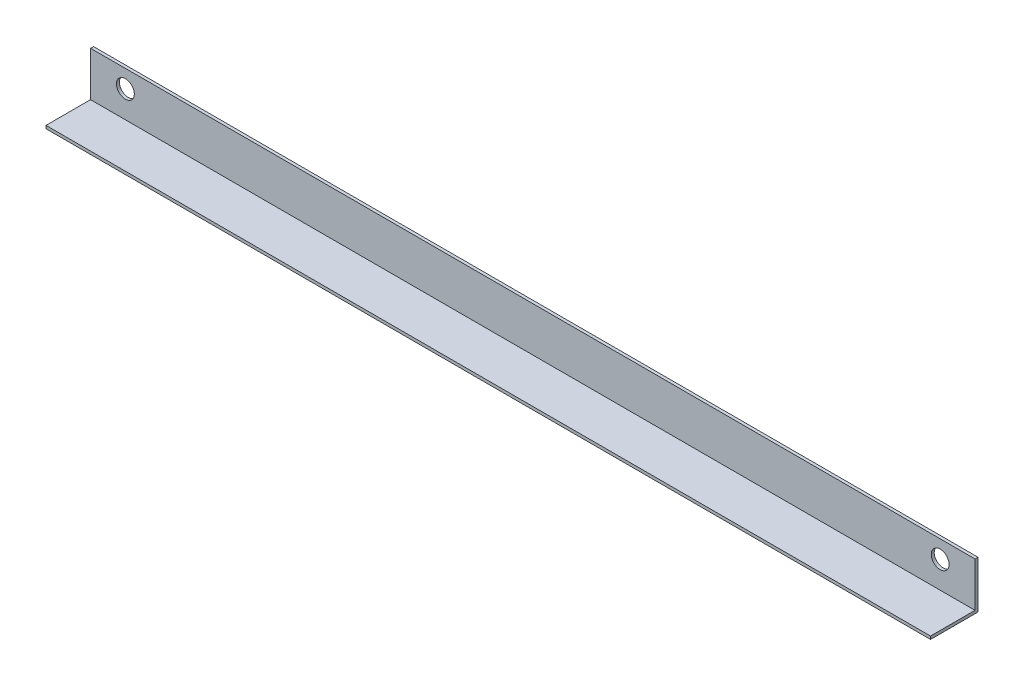
ISO-10303-21;
HEADER;
FILE_DESCRIPTION(('STEP AP214'),'2;1');
FILE_NAME('part.step','',(''),(''),'','','');
FILE_SCHEMA(('AUTOMOTIVE_DESIGN { 1 0 10303 214 1 1 1 1 }'));
ENDSEC;
DATA;
#1=APPLICATION_CONTEXT('core data for automotive mechanical design processes');
#2=APPLICATION_PROTOCOL_DEFINITION('international standard','automotive_design',2000,#1);
#3=PRODUCT_CONTEXT('',#1,'mechanical');
#4=PRODUCT('Part','Part','',(#3));
#5=PRODUCT_RELATED_PRODUCT_CATEGORY('part','',(#4));
#6=PRODUCT_DEFINITION_FORMATION('','',#4);
#7=PRODUCT_DEFINITION_CONTEXT('part definition',#1,'design');
#8=PRODUCT_DEFINITION('design','',#6,#7);
#9=PRODUCT_DEFINITION_SHAPE('','',#8);
#10=(LENGTH_UNIT() NAMED_UNIT(*) SI_UNIT(.MILLI.,.METRE.));
#11=(NAMED_UNIT(*) PLANE_ANGLE_UNIT() SI_UNIT($,.RADIAN.));
#12=(NAMED_UNIT(*) SI_UNIT($,.STERADIAN.) SOLID_ANGLE_UNIT());
#13=UNCERTAINTY_MEASURE_WITH_UNIT(LENGTH_MEASURE(1.E-05),#10,'distance_accuracy_value','');
#14=(GEOMETRIC_REPRESENTATION_CONTEXT(3) GLOBAL_UNCERTAINTY_ASSIGNED_CONTEXT((#13)) GLOBAL_UNIT_ASSIGNED_CONTEXT((#10,
#11,#12)) REPRESENTATION_CONTEXT('',''));
#15=CARTESIAN_POINT('',(0.,0.,0.));
#16=DIRECTION('',(0.,0.,1.));
#17=DIRECTION('',(1.,0.,0.));
#18=AXIS2_PLACEMENT_3D('',#15,#16,#17);
#19=CARTESIAN_POINT('',(-473.075,22.225,-25.4));
#20=DIRECTION('',(0.,0.,1.));
#21=DIRECTION('',(1.,0.,0.));
#22=AXIS2_PLACEMENT_3D('',#19,#20,#21);
#23=PLANE('',#22);
#24=CARTESIAN_POINT('',(435.76875,3.175,-25.4));
#25=DIRECTION('',(0.,0.,1.));
#26=DIRECTION('',(1.,0.,0.));
#27=AXIS2_PLACEMENT_3D('',#24,#25,#26);
#28=CIRCLE('',#27,9.525);
#29=CARTESIAN_POINT('',(445.29375,3.175,-25.4));
#30=VERTEX_POINT('',#29);
#31=EDGE_CURVE('E90',#30,#30,#28,.F.);
#32=ORIENTED_EDGE('',*,*,#31,.T.);
#33=EDGE_LOOP('',(#32));
#34=FACE_BOUND('',#33,.T.);
#35=CARTESIAN_POINT('',(-435.76875,3.175,-25.4));
#36=DIRECTION('',(0.,0.,1.));
#37=DIRECTION('',(1.,0.,0.));
#38=AXIS2_PLACEMENT_3D('',#35,#36,#37);
#39=CIRCLE('',#38,9.525);
#40=CARTESIAN_POINT('',(-426.24375,3.175,-25.4));
#41=VERTEX_POINT('',#40);
#42=EDGE_CURVE('E20',#41,#41,#39,.F.);
#43=ORIENTED_EDGE('',*,*,#42,.T.);
#44=EDGE_LOOP('',(#43));
#45=FACE_BOUND('',#44,.T.);
#46=DIRECTION('',(0.,1.,0.));
#47=VECTOR('',#46,1.);
#48=CARTESIAN_POINT('',(-473.075,0.,-25.4));
#49=LINE('',#48,#47);
#50=CARTESIAN_POINT('',(-473.075,22.225,-25.4));
#51=VERTEX_POINT('',#50);
#52=CARTESIAN_POINT('',(-473.075,-25.4,-25.4));
#53=VERTEX_POINT('',#52);
#54=EDGE_CURVE('E116',#51,#53,#49,.F.);
#55=ORIENTED_EDGE('',*,*,#54,.T.);
#56=DIRECTION('',(1.,0.,0.));
#57=VECTOR('',#56,1.);
#58=CARTESIAN_POINT('',(-473.075,-25.4,-25.4));
#59=LINE('',#58,#57);
#60=CARTESIAN_POINT('',(473.075,-25.4,-25.4));
#61=VERTEX_POINT('',#60);
#62=EDGE_CURVE('E67',#61,#53,#59,.F.);
#63=ORIENTED_EDGE('',*,*,#62,.F.);
#64=DIRECTION('',(0.,1.,0.));
#65=VECTOR('',#64,1.);
#66=CARTESIAN_POINT('',(473.075,0.,-25.4));
#67=LINE('',#66,#65);
#68=CARTESIAN_POINT('',(473.075,22.225,-25.4));
#69=VERTEX_POINT('',#68);
#70=EDGE_CURVE('E82',#69,#61,#67,.F.);
#71=ORIENTED_EDGE('',*,*,#70,.F.);
#72=DIRECTION('',(1.,0.,0.));
#73=VECTOR('',#72,1.);
#74=CARTESIAN_POINT('',(-473.075,22.225,-25.4));
#75=LINE('',#74,#73);
#76=EDGE_CURVE('E72',#51,#69,#75,.T.);
#77=ORIENTED_EDGE('',*,*,#76,.F.);
#78=EDGE_LOOP('',(#55,#63,#71,#77));
#79=FACE_BOUND('',#78,.T.);
#80=ADVANCED_FACE('F17',(#34,#45,#79),#23,.T.);
#81=CARTESIAN_POINT('',(-473.075,-25.4,-25.4));
#82=DIRECTION('',(0.,1.,0.));
#83=DIRECTION('',(0.,0.,1.));
#84=AXIS2_PLACEMENT_3D('',#81,#82,#83);
#85=PLANE('',#84);
#86=DIRECTION('',(0.,0.,-1.));
#87=VECTOR('',#86,1.);
#88=CARTESIAN_POINT('',(-473.075,-25.4,0.));
#89=LINE('',#88,#87);
#90=CARTESIAN_POINT('',(-473.075,-25.4,22.225));
#91=VERTEX_POINT('',#90);
#92=EDGE_CURVE('E114',#53,#91,#89,.F.);
#93=ORIENTED_EDGE('',*,*,#92,.T.);
#94=DIRECTION('',(1.,0.,0.));
#95=VECTOR('',#94,1.);
#96=CARTESIAN_POINT('',(-473.075,-25.4,22.225));
#97=LINE('',#96,#95);
#98=CARTESIAN_POINT('',(473.075,-25.4,22.225));
#99=VERTEX_POINT('',#98);
#100=EDGE_CURVE('E119',#99,#91,#97,.F.);
#101=ORIENTED_EDGE('',*,*,#100,.F.);
#102=DIRECTION('',(0.,0.,-1.));
#103=VECTOR('',#102,1.);
#104=CARTESIAN_POINT('',(473.075,-25.4,0.));
#105=LINE('',#104,#103);
#106=EDGE_CURVE('E84',#61,#99,#105,.F.);
#107=ORIENTED_EDGE('',*,*,#106,.F.);
#108=ORIENTED_EDGE('',*,*,#62,.T.);
#109=EDGE_LOOP('',(#93,#101,#107,#108));
#110=FACE_BOUND('',#109,.T.);
#111=ADVANCED_FACE('F127',(#110),#85,.T.);
#112=CARTESIAN_POINT('',(-473.075,22.225,-28.575));
#113=DIRECTION('',(0.,1.,0.));
#114=DIRECTION('',(0.,0.,1.));
#115=AXIS2_PLACEMENT_3D('',#112,#113,#114);
#116=PLANE('',#115);
#117=DIRECTION('',(0.,0.,-1.));
#118=VECTOR('',#117,1.);
#119=CARTESIAN_POINT('',(-473.075,22.225,0.));
#120=LINE('',#119,#118);
#121=CARTESIAN_POINT('',(-473.075,22.225,-28.575));
#122=VERTEX_POINT('',#121);
#123=EDGE_CURVE('E78',#122,#51,#120,.F.);
#124=ORIENTED_EDGE('',*,*,#123,.T.);
#125=ORIENTED_EDGE('',*,*,#76,.T.);
#126=DIRECTION('',(0.,0.,-1.));
#127=VECTOR('',#126,1.);
#128=CARTESIAN_POINT('',(473.075,22.225,0.));
#129=LINE('',#128,#127);
#130=CARTESIAN_POINT('',(473.075,22.225,-28.575));
#131=VERTEX_POINT('',#130);
#132=EDGE_CURVE('E76',#131,#69,#129,.F.);
#133=ORIENTED_EDGE('',*,*,#132,.F.);
#134=DIRECTION('',(-1.,0.,0.));
#135=VECTOR('',#134,1.);
#136=CARTESIAN_POINT('',(-473.075,22.225,-28.575));
#137=LINE('',#136,#135);
#138=EDGE_CURVE('E102',#122,#131,#137,.F.);
#139=ORIENTED_EDGE('',*,*,#138,.F.);
#140=EDGE_LOOP('',(#124,#125,#133,#139));
#141=FACE_BOUND('',#140,.T.);
#142=ADVANCED_FACE('F73',(#141),#116,.T.);
#143=CARTESIAN_POINT('',(-435.76875,3.175,-28.575));
#144=DIRECTION('',(0.,0.,1.));
#145=DIRECTION('',(1.,0.,0.));
#146=AXIS2_PLACEMENT_3D('',#143,#144,#145);
#147=CYLINDRICAL_SURFACE('',#146,9.525);
#148=ORIENTED_EDGE('',*,*,#42,.F.);
#149=EDGE_LOOP('',(#148));
#150=FACE_BOUND('',#149,.T.);
#151=CARTESIAN_POINT('',(-435.76875,3.175,-28.575));
#152=DIRECTION('',(0.,0.,1.));
#153=DIRECTION('',(1.,0.,0.));
#154=AXIS2_PLACEMENT_3D('',#151,#152,#153);
#155=CIRCLE('',#154,9.525);
#156=CARTESIAN_POINT('',(-426.24375,3.175,-28.575));
#157=VERTEX_POINT('',#156);
#158=EDGE_CURVE('E100',#157,#157,#155,.T.);
#159=ORIENTED_EDGE('',*,*,#158,.F.);
#160=EDGE_LOOP('',(#159));
#161=FACE_BOUND('',#160,.T.);
#162=ADVANCED_FACE('F192',(#150,#161),#147,.F.);
#163=CARTESIAN_POINT('',(435.76875,3.175,-28.575));
#164=DIRECTION('',(0.,0.,1.));
#165=DIRECTION('',(1.,0.,0.));
#166=AXIS2_PLACEMENT_3D('',#163,#164,#165);
#167=CYLINDRICAL_SURFACE('',#166,9.525);
#168=ORIENTED_EDGE('',*,*,#31,.F.);
#169=EDGE_LOOP('',(#168));
#170=FACE_BOUND('',#169,.T.);
#171=CARTESIAN_POINT('',(435.76875,3.175,-28.575));
#172=DIRECTION('',(0.,0.,1.));
#173=DIRECTION('',(1.,0.,0.));
#174=AXIS2_PLACEMENT_3D('',#171,#172,#173);
#175=CIRCLE('',#174,9.525);
#176=CARTESIAN_POINT('',(445.29375,3.175,-28.575));
#177=VERTEX_POINT('',#176);
#178=EDGE_CURVE('E96',#177,#177,#175,.T.);
#179=ORIENTED_EDGE('',*,*,#178,.F.);
#180=EDGE_LOOP('',(#179));
#181=FACE_BOUND('',#180,.T.);
#182=ADVANCED_FACE('F183',(#170,#181),#167,.F.);
#183=CARTESIAN_POINT('',(473.075,0.,0.));
#184=DIRECTION('',(1.,0.,0.));
#185=DIRECTION('',(0.,0.,-1.));
#186=AXIS2_PLACEMENT_3D('',#183,#184,#185);
#187=PLANE('',#186);
#188=ORIENTED_EDGE('',*,*,#106,.T.);
#189=DIRECTION('',(0.,1.,0.));
#190=VECTOR('',#189,1.);
#191=CARTESIAN_POINT('',(473.075,-25.4,22.225));
#192=LINE('',#191,#190);
#193=CARTESIAN_POINT('',(473.075,-28.575,22.225));
#194=VERTEX_POINT('',#193);
#195=EDGE_CURVE('E122',#194,#99,#192,.T.);
#196=ORIENTED_EDGE('',*,*,#195,.F.);
#197=DIRECTION('',(0.,0.,-1.));
#198=VECTOR('',#197,1.);
#199=CARTESIAN_POINT('',(473.075,-28.575,22.225));
#200=LINE('',#199,#198);
#201=CARTESIAN_POINT('',(473.075,-28.575,-28.575));
#202=VERTEX_POINT('',#201);
#203=EDGE_CURVE('E99',#202,#194,#200,.F.);
#204=ORIENTED_EDGE('',*,*,#203,.F.);
#205=DIRECTION('',(0.,1.,0.));
#206=VECTOR('',#205,1.);
#207=CARTESIAN_POINT('',(473.075,-28.575,-28.575));
#208=LINE('',#207,#206);
#209=EDGE_CURVE('E88',#131,#202,#208,.F.);
#210=ORIENTED_EDGE('',*,*,#209,.F.);
#211=ORIENTED_EDGE('',*,*,#132,.T.);
#212=ORIENTED_EDGE('',*,*,#70,.T.);
#213=EDGE_LOOP('',(#188,#196,#204,#210,#211,#212));
#214=FACE_BOUND('',#213,.T.);
#215=ADVANCED_FACE('F86',(#214),#187,.T.);
#216=CARTESIAN_POINT('',(-473.075,-25.4,22.225));
#217=DIRECTION('',(0.,0.,1.));
#218=DIRECTION('',(1.,0.,0.));
#219=AXIS2_PLACEMENT_3D('',#216,#217,#218);
#220=PLANE('',#219);
#221=DIRECTION('',(0.,1.,0.));
#222=VECTOR('',#221,1.);
#223=CARTESIAN_POINT('',(-473.075,0.,22.225));
#224=LINE('',#223,#222);
#225=CARTESIAN_POINT('',(-473.075,-28.575,22.225));
#226=VERTEX_POINT('',#225);
#227=EDGE_CURVE('E112',#91,#226,#224,.F.);
#228=ORIENTED_EDGE('',*,*,#227,.T.);
#229=DIRECTION('',(1.,0.,0.));
#230=VECTOR('',#229,1.);
#231=CARTESIAN_POINT('',(-473.075,-28.575,22.225));
#232=LINE('',#231,#230);
#233=EDGE_CURVE('E133',#194,#226,#232,.F.);
#234=ORIENTED_EDGE('',*,*,#233,.F.);
#235=ORIENTED_EDGE('',*,*,#195,.T.);
#236=ORIENTED_EDGE('',*,*,#100,.T.);
#237=EDGE_LOOP('',(#228,#234,#235,#236));
#238=FACE_BOUND('',#237,.T.);
#239=ADVANCED_FACE('F131',(#238),#220,.T.);
#240=CARTESIAN_POINT('',(-473.075,0.,0.));
#241=DIRECTION('',(1.,0.,0.));
#242=DIRECTION('',(0.,0.,-1.));
#243=AXIS2_PLACEMENT_3D('',#240,#241,#242);
#244=PLANE('',#243);
#245=DIRECTION('',(0.,0.,-1.));
#246=VECTOR('',#245,1.);
#247=CARTESIAN_POINT('',(-473.075,-28.575,22.225));
#248=LINE('',#247,#246);
#249=CARTESIAN_POINT('',(-473.075,-28.575,-28.575));
#250=VERTEX_POINT('',#249);
#251=EDGE_CURVE('E26',#226,#250,#248,.T.);
#252=ORIENTED_EDGE('',*,*,#251,.F.);
#253=ORIENTED_EDGE('',*,*,#227,.F.);
#254=ORIENTED_EDGE('',*,*,#92,.F.);
#255=ORIENTED_EDGE('',*,*,#54,.F.);
#256=ORIENTED_EDGE('',*,*,#123,.F.);
#257=DIRECTION('',(0.,1.,0.));
#258=VECTOR('',#257,1.);
#259=CARTESIAN_POINT('',(-473.075,-28.575,-28.575));
#260=LINE('',#259,#258);
#261=EDGE_CURVE('E35',#250,#122,#260,.T.);
#262=ORIENTED_EDGE('',*,*,#261,.F.);
#263=EDGE_LOOP('',(#252,#253,#254,#255,#256,#262));
#264=FACE_BOUND('',#263,.T.);
#265=ADVANCED_FACE('F140',(#264),#244,.F.);
#266=CARTESIAN_POINT('',(-473.075,-28.575,-28.575));
#267=DIRECTION('',(0.,0.,-1.));
#268=DIRECTION('',(-1.,0.,0.));
#269=AXIS2_PLACEMENT_3D('',#266,#267,#268);
#270=PLANE('',#269);
#271=ORIENTED_EDGE('',*,*,#178,.T.);
#272=EDGE_LOOP('',(#271));
#273=FACE_BOUND('',#272,.T.);
#274=ORIENTED_EDGE('',*,*,#158,.T.);
#275=EDGE_LOOP('',(#274));
#276=FACE_BOUND('',#275,.T.);
#277=ORIENTED_EDGE('',*,*,#261,.T.);
#278=ORIENTED_EDGE('',*,*,#138,.T.);
#279=ORIENTED_EDGE('',*,*,#209,.T.);
#280=DIRECTION('',(1.,0.,0.));
#281=VECTOR('',#280,1.);
#282=CARTESIAN_POINT('',(-473.075,-28.575,-28.575));
#283=LINE('',#282,#281);
#284=EDGE_CURVE('E11',#250,#202,#283,.T.);
#285=ORIENTED_EDGE('',*,*,#284,.F.);
#286=EDGE_LOOP('',(#277,#278,#279,#285));
#287=FACE_BOUND('',#286,.T.);
#288=ADVANCED_FACE('F138',(#273,#276,#287),#270,.T.);
#289=CARTESIAN_POINT('',(-473.075,-28.575,22.225));
#290=DIRECTION('',(0.,-1.,0.));
#291=DIRECTION('',(0.,0.,-1.));
#292=AXIS2_PLACEMENT_3D('',#289,#290,#291);
#293=PLANE('',#292);
#294=ORIENTED_EDGE('',*,*,#251,.T.);
#295=ORIENTED_EDGE('',*,*,#284,.T.);
#296=ORIENTED_EDGE('',*,*,#203,.T.);
#297=ORIENTED_EDGE('',*,*,#233,.T.);
#298=EDGE_LOOP('',(#294,#295,#296,#297));
#299=FACE_BOUND('',#298,.T.);
#300=ADVANCED_FACE('F137',(#299),#293,.T.);
#301=CLOSED_SHELL('',(#80,#111,#142,#162,#182,#215,#239,#265,#288,#300));
#302=MANIFOLD_SOLID_BREP('B1',#301);
#303=ADVANCED_BREP_SHAPE_REPRESENTATION('',(#18,#302),#14);
#304=SHAPE_DEFINITION_REPRESENTATION(#9,#303);
ENDSEC;
END-ISO-10303-21;
